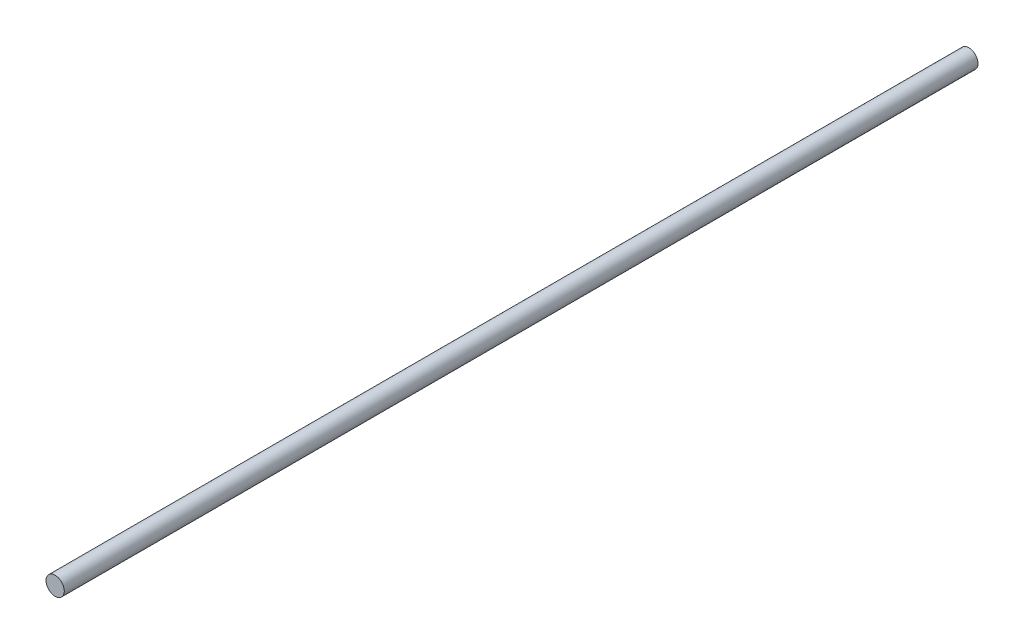
ISO-10303-21;
HEADER;
FILE_DESCRIPTION(('STEP AP214'),'2;1');
FILE_NAME('part.step','',(''),(''),'','','');
FILE_SCHEMA(('AUTOMOTIVE_DESIGN { 1 0 10303 214 1 1 1 1 }'));
ENDSEC;
DATA;
#1=APPLICATION_CONTEXT('core data for automotive mechanical design processes');
#2=APPLICATION_PROTOCOL_DEFINITION('international standard','automotive_design',2000,#1);
#3=PRODUCT_CONTEXT('',#1,'mechanical');
#4=PRODUCT('Part','Part','',(#3));
#5=PRODUCT_RELATED_PRODUCT_CATEGORY('part','',(#4));
#6=PRODUCT_DEFINITION_FORMATION('','',#4);
#7=PRODUCT_DEFINITION_CONTEXT('part definition',#1,'design');
#8=PRODUCT_DEFINITION('design','',#6,#7);
#9=PRODUCT_DEFINITION_SHAPE('','',#8);
#10=(LENGTH_UNIT() NAMED_UNIT(*) SI_UNIT(.MILLI.,.METRE.));
#11=(NAMED_UNIT(*) PLANE_ANGLE_UNIT() SI_UNIT($,.RADIAN.));
#12=(NAMED_UNIT(*) SI_UNIT($,.STERADIAN.) SOLID_ANGLE_UNIT());
#13=UNCERTAINTY_MEASURE_WITH_UNIT(LENGTH_MEASURE(1.E-05),#10,'distance_accuracy_value','');
#14=(GEOMETRIC_REPRESENTATION_CONTEXT(3) GLOBAL_UNCERTAINTY_ASSIGNED_CONTEXT((#13)) GLOBAL_UNIT_ASSIGNED_CONTEXT((#10,
#11,#12)) REPRESENTATION_CONTEXT('',''));
#15=CARTESIAN_POINT('',(0.,0.,0.));
#16=DIRECTION('',(0.,0.,1.));
#17=DIRECTION('',(1.,0.,0.));
#18=AXIS2_PLACEMENT_3D('',#15,#16,#17);
#19=CARTESIAN_POINT('',(0.,0.,250.));
#20=DIRECTION('',(0.,0.,1.));
#21=DIRECTION('',(1.,0.,0.));
#22=AXIS2_PLACEMENT_3D('',#19,#20,#21);
#23=PLANE('',#22);
#24=CARTESIAN_POINT('',(0.,0.,250.));
#25=DIRECTION('',(0.,0.,-1.));
#26=DIRECTION('',(-1.,0.,0.));
#27=AXIS2_PLACEMENT_3D('',#24,#25,#26);
#28=CIRCLE('',#27,2.5);
#29=CARTESIAN_POINT('',(-2.5,0.,250.));
#30=VERTEX_POINT('',#29);
#31=EDGE_CURVE('E18',#30,#30,#28,.T.);
#32=ORIENTED_EDGE('',*,*,#31,.F.);
#33=EDGE_LOOP('',(#32));
#34=FACE_BOUND('',#33,.T.);
#35=ADVANCED_FACE('F15',(#34),#23,.T.);
#36=CARTESIAN_POINT('',(0.,0.,0.));
#37=DIRECTION('',(0.,0.,1.));
#38=DIRECTION('',(1.,0.,0.));
#39=AXIS2_PLACEMENT_3D('',#36,#37,#38);
#40=PLANE('',#39);
#41=CARTESIAN_POINT('',(0.,0.,0.));
#42=DIRECTION('',(0.,0.,-1.));
#43=DIRECTION('',(-1.,0.,0.));
#44=AXIS2_PLACEMENT_3D('',#41,#42,#43);
#45=CIRCLE('',#44,2.5);
#46=CARTESIAN_POINT('',(-2.5,0.,0.));
#47=VERTEX_POINT('',#46);
#48=EDGE_CURVE('E10',#47,#47,#45,.F.);
#49=ORIENTED_EDGE('',*,*,#48,.F.);
#50=EDGE_LOOP('',(#49));
#51=FACE_BOUND('',#50,.T.);
#52=ADVANCED_FACE('F33',(#51),#40,.F.);
#53=CARTESIAN_POINT('',(0.,0.,250.));
#54=DIRECTION('',(0.,0.,-1.));
#55=DIRECTION('',(-1.,0.,0.));
#56=AXIS2_PLACEMENT_3D('',#53,#54,#55);
#57=CYLINDRICAL_SURFACE('',#56,2.5);
#58=ORIENTED_EDGE('',*,*,#48,.T.);
#59=EDGE_LOOP('',(#58));
#60=FACE_BOUND('',#59,.T.);
#61=ORIENTED_EDGE('',*,*,#31,.T.);
#62=EDGE_LOOP('',(#61));
#63=FACE_BOUND('',#62,.T.);
#64=ADVANCED_FACE('F30',(#60,#63),#57,.T.);
#65=CLOSED_SHELL('',(#35,#52,#64));
#66=MANIFOLD_SOLID_BREP('B1',#65);
#67=ADVANCED_BREP_SHAPE_REPRESENTATION('',(#18,#66),#14);
#68=SHAPE_DEFINITION_REPRESENTATION(#9,#67);
ENDSEC;
END-ISO-10303-21;
